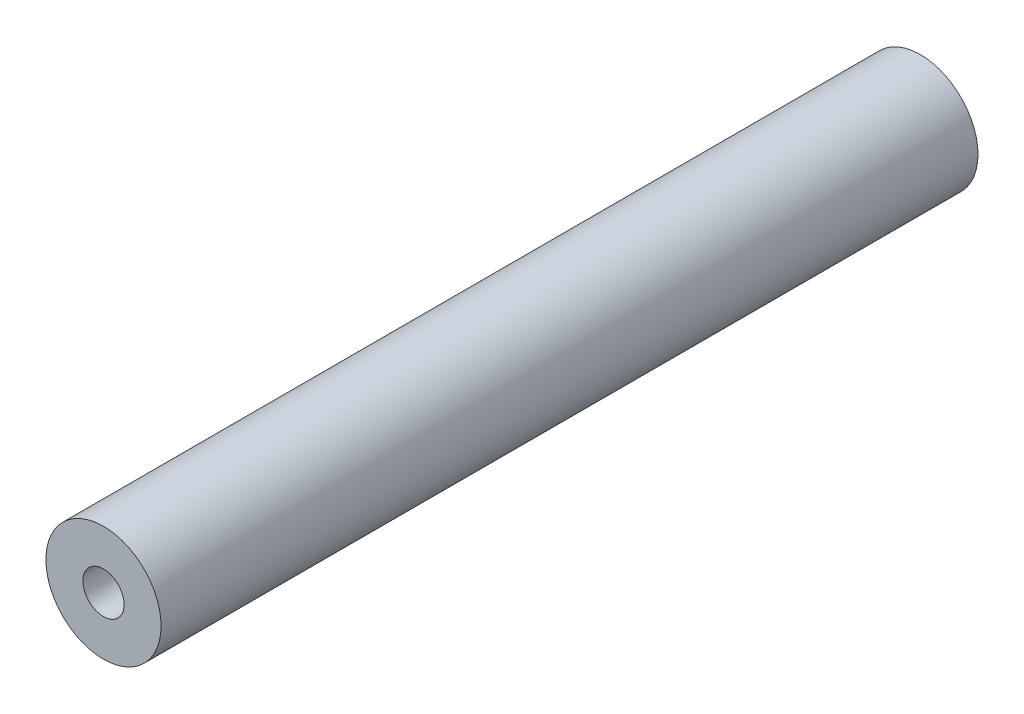
ISO-10303-21;
HEADER;
FILE_DESCRIPTION(('STEP AP214'),'2;1');
FILE_NAME('part.step','',(''),(''),'','','');
FILE_SCHEMA(('AUTOMOTIVE_DESIGN { 1 0 10303 214 1 1 1 1 }'));
ENDSEC;
DATA;
#1=APPLICATION_CONTEXT('core data for automotive mechanical design processes');
#2=APPLICATION_PROTOCOL_DEFINITION('international standard','automotive_design',2000,#1);
#3=PRODUCT_CONTEXT('',#1,'mechanical');
#4=PRODUCT('Part','Part','',(#3));
#5=PRODUCT_RELATED_PRODUCT_CATEGORY('part','',(#4));
#6=PRODUCT_DEFINITION_FORMATION('','',#4);
#7=PRODUCT_DEFINITION_CONTEXT('part definition',#1,'design');
#8=PRODUCT_DEFINITION('design','',#6,#7);
#9=PRODUCT_DEFINITION_SHAPE('','',#8);
#10=(LENGTH_UNIT() NAMED_UNIT(*) SI_UNIT(.MILLI.,.METRE.));
#11=(NAMED_UNIT(*) PLANE_ANGLE_UNIT() SI_UNIT($,.RADIAN.));
#12=(NAMED_UNIT(*) SI_UNIT($,.STERADIAN.) SOLID_ANGLE_UNIT());
#13=UNCERTAINTY_MEASURE_WITH_UNIT(LENGTH_MEASURE(1.E-05),#10,'distance_accuracy_value','');
#14=(GEOMETRIC_REPRESENTATION_CONTEXT(3) GLOBAL_UNCERTAINTY_ASSIGNED_CONTEXT((#13)) GLOBAL_UNIT_ASSIGNED_CONTEXT((#10,
#11,#12)) REPRESENTATION_CONTEXT('',''));
#15=CARTESIAN_POINT('',(0.,0.,0.));
#16=DIRECTION('',(0.,0.,1.));
#17=DIRECTION('',(1.,0.,0.));
#18=AXIS2_PLACEMENT_3D('',#15,#16,#17);
#19=CARTESIAN_POINT('',(0.,0.,68.453));
#20=DIRECTION('',(0.,0.,1.));
#21=DIRECTION('',(1.,0.,0.));
#22=AXIS2_PLACEMENT_3D('',#19,#20,#21);
#23=PLANE('',#22);
#24=CARTESIAN_POINT('',(0.,0.,68.453));
#25=DIRECTION('',(0.,0.,1.));
#26=DIRECTION('',(1.,0.,0.));
#27=AXIS2_PLACEMENT_3D('',#24,#25,#26);
#28=CIRCLE('',#27,4.826);
#29=CARTESIAN_POINT('',(4.826,0.,68.453));
#30=VERTEX_POINT('',#29);
#31=EDGE_CURVE('E10',#30,#30,#28,.T.);
#32=ORIENTED_EDGE('',*,*,#31,.T.);
#33=EDGE_LOOP('',(#32));
#34=FACE_BOUND('',#33,.T.);
#35=CARTESIAN_POINT('',(0.,0.,68.453));
#36=DIRECTION('',(0.,0.,1.));
#37=DIRECTION('',(1.,0.,0.));
#38=AXIS2_PLACEMENT_3D('',#35,#36,#37);
#39=CIRCLE('',#38,1.7272);
#40=CARTESIAN_POINT('',(1.7272,0.,68.453));
#41=VERTEX_POINT('',#40);
#42=EDGE_CURVE('E42',#41,#41,#39,.T.);
#43=ORIENTED_EDGE('',*,*,#42,.F.);
#44=EDGE_LOOP('',(#43));
#45=FACE_BOUND('',#44,.T.);
#46=ADVANCED_FACE('F31',(#34,#45),#23,.T.);
#47=CARTESIAN_POINT('',(0.,0.,0.));
#48=DIRECTION('',(0.,0.,1.));
#49=DIRECTION('',(1.,0.,0.));
#50=AXIS2_PLACEMENT_3D('',#47,#48,#49);
#51=PLANE('',#50);
#52=CARTESIAN_POINT('',(0.,0.,0.));
#53=DIRECTION('',(0.,0.,1.));
#54=DIRECTION('',(1.,0.,0.));
#55=AXIS2_PLACEMENT_3D('',#52,#53,#54);
#56=CIRCLE('',#55,4.826);
#57=CARTESIAN_POINT('',(4.826,0.,0.));
#58=VERTEX_POINT('',#57);
#59=EDGE_CURVE('E35',#58,#58,#56,.T.);
#60=ORIENTED_EDGE('',*,*,#59,.F.);
#61=EDGE_LOOP('',(#60));
#62=FACE_BOUND('',#61,.T.);
#63=CARTESIAN_POINT('',(0.,0.,0.));
#64=DIRECTION('',(0.,0.,1.));
#65=DIRECTION('',(1.,0.,0.));
#66=AXIS2_PLACEMENT_3D('',#63,#64,#65);
#67=CIRCLE('',#66,1.7272);
#68=CARTESIAN_POINT('',(1.7272,0.,0.));
#69=VERTEX_POINT('',#68);
#70=EDGE_CURVE('E44',#69,#69,#67,.T.);
#71=ORIENTED_EDGE('',*,*,#70,.T.);
#72=EDGE_LOOP('',(#71));
#73=FACE_BOUND('',#72,.T.);
#74=ADVANCED_FACE('F54',(#62,#73),#51,.F.);
#75=CARTESIAN_POINT('',(0.,0.,68.453));
#76=DIRECTION('',(0.,0.,-1.));
#77=DIRECTION('',(-1.,0.,0.));
#78=AXIS2_PLACEMENT_3D('',#75,#76,#77);
#79=CYLINDRICAL_SURFACE('',#78,4.826);
#80=ORIENTED_EDGE('',*,*,#31,.F.);
#81=EDGE_LOOP('',(#80));
#82=FACE_BOUND('',#81,.T.);
#83=ORIENTED_EDGE('',*,*,#59,.T.);
#84=EDGE_LOOP('',(#83));
#85=FACE_BOUND('',#84,.T.);
#86=ADVANCED_FACE('F33',(#82,#85),#79,.T.);
#87=CARTESIAN_POINT('',(0.,0.,68.453));
#88=DIRECTION('',(0.,0.,-1.));
#89=DIRECTION('',(-1.,0.,0.));
#90=AXIS2_PLACEMENT_3D('',#87,#88,#89);
#91=CYLINDRICAL_SURFACE('',#90,1.7272);
#92=ORIENTED_EDGE('',*,*,#42,.T.);
#93=EDGE_LOOP('',(#92));
#94=FACE_BOUND('',#93,.T.);
#95=ORIENTED_EDGE('',*,*,#70,.F.);
#96=EDGE_LOOP('',(#95));
#97=FACE_BOUND('',#96,.T.);
#98=ADVANCED_FACE('F50',(#94,#97),#91,.F.);
#99=CLOSED_SHELL('',(#46,#74,#86,#98));
#100=MANIFOLD_SOLID_BREP('B2',#99);
#101=ADVANCED_BREP_SHAPE_REPRESENTATION('',(#18,#100),#14);
#102=SHAPE_DEFINITION_REPRESENTATION(#9,#101);
ENDSEC;
END-ISO-10303-21;
